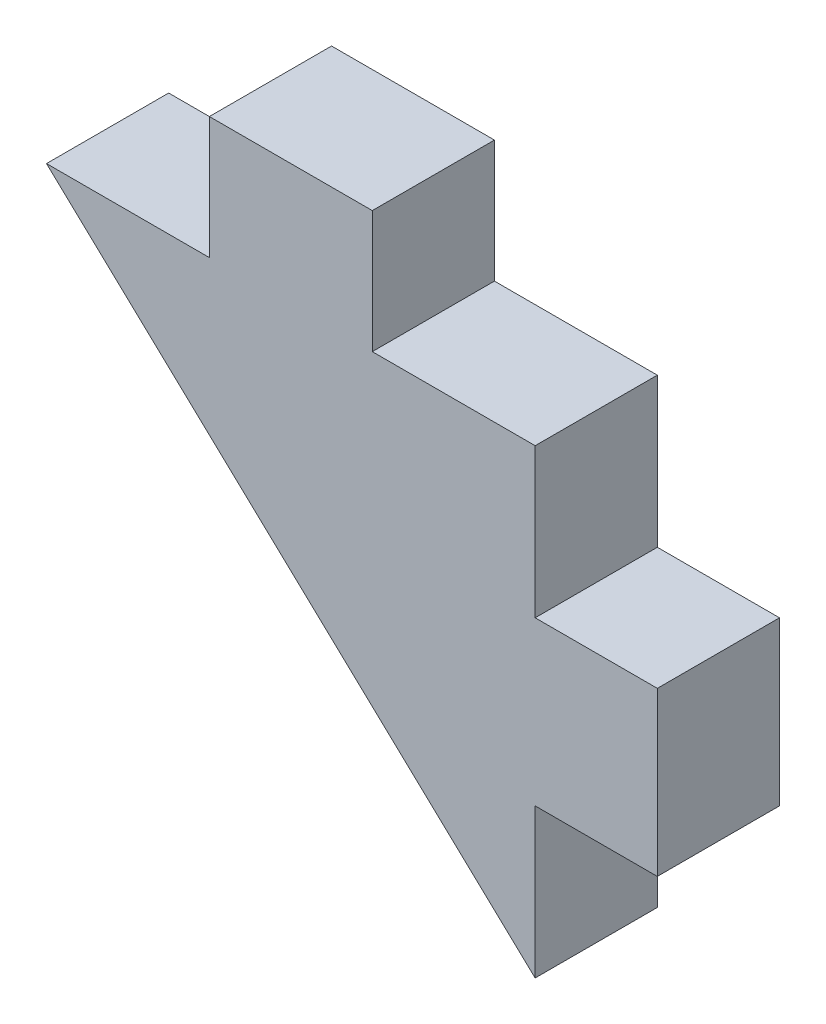
ISO-10303-21;
HEADER;
FILE_DESCRIPTION(('STEP AP214'),'2;1');
FILE_NAME('part.step','',(''),(''),'','','');
FILE_SCHEMA(('AUTOMOTIVE_DESIGN { 1 0 10303 214 1 1 1 1 }'));
ENDSEC;
DATA;
#1=APPLICATION_CONTEXT('core data for automotive mechanical design processes');
#2=APPLICATION_PROTOCOL_DEFINITION('international standard','automotive_design',2000,#1);
#3=PRODUCT_CONTEXT('',#1,'mechanical');
#4=PRODUCT('Part','Part','',(#3));
#5=PRODUCT_RELATED_PRODUCT_CATEGORY('part','',(#4));
#6=PRODUCT_DEFINITION_FORMATION('','',#4);
#7=PRODUCT_DEFINITION_CONTEXT('part definition',#1,'design');
#8=PRODUCT_DEFINITION('design','',#6,#7);
#9=PRODUCT_DEFINITION_SHAPE('','',#8);
#10=(LENGTH_UNIT() NAMED_UNIT(*) SI_UNIT(.MILLI.,.METRE.));
#11=(NAMED_UNIT(*) PLANE_ANGLE_UNIT() SI_UNIT($,.RADIAN.));
#12=(NAMED_UNIT(*) SI_UNIT($,.STERADIAN.) SOLID_ANGLE_UNIT());
#13=UNCERTAINTY_MEASURE_WITH_UNIT(LENGTH_MEASURE(1.E-05),#10,'distance_accuracy_value','');
#14=(GEOMETRIC_REPRESENTATION_CONTEXT(3) GLOBAL_UNCERTAINTY_ASSIGNED_CONTEXT((#13)) GLOBAL_UNIT_ASSIGNED_CONTEXT((#10,
#11,#12)) REPRESENTATION_CONTEXT('',''));
#15=CARTESIAN_POINT('',(0.,0.,0.));
#16=DIRECTION('',(0.,0.,1.));
#17=DIRECTION('',(1.,0.,0.));
#18=AXIS2_PLACEMENT_3D('',#15,#16,#17);
#19=CARTESIAN_POINT('',(10.,3.33333333333333,5.));
#20=DIRECTION('',(-1.,0.,0.));
#21=DIRECTION('',(0.,-1.,0.));
#22=AXIS2_PLACEMENT_3D('',#19,#20,#21);
#23=PLANE('',#22);
#24=DIRECTION('',(0.,1.,0.));
#25=VECTOR('',#24,1.);
#26=CARTESIAN_POINT('',(10.,3.33333333333333,0.));
#27=LINE('',#26,#25);
#28=CARTESIAN_POINT('',(10.,3.33333333333333,0.));
#29=VERTEX_POINT('',#28);
#30=CARTESIAN_POINT('',(10.,9.43396226415095,0.));
#31=VERTEX_POINT('',#30);
#32=EDGE_CURVE('E144',#29,#31,#27,.T.);
#33=ORIENTED_EDGE('',*,*,#32,.T.);
#34=DIRECTION('',(0.,0.,-1.));
#35=VECTOR('',#34,1.);
#36=CARTESIAN_POINT('',(10.,9.43396226415095,5.));
#37=LINE('',#36,#35);
#38=CARTESIAN_POINT('',(10.,9.43396226415095,5.));
#39=VERTEX_POINT('',#38);
#40=EDGE_CURVE('E11',#39,#31,#37,.T.);
#41=ORIENTED_EDGE('',*,*,#40,.F.);
#42=DIRECTION('',(0.,1.,0.));
#43=VECTOR('',#42,1.);
#44=CARTESIAN_POINT('',(10.,3.33333333333333,5.));
#45=LINE('',#44,#43);
#46=CARTESIAN_POINT('',(10.,3.33333333333333,5.));
#47=VERTEX_POINT('',#46);
#48=EDGE_CURVE('E164',#47,#39,#45,.T.);
#49=ORIENTED_EDGE('',*,*,#48,.F.);
#50=DIRECTION('',(0.,0.,-1.));
#51=VECTOR('',#50,1.);
#52=CARTESIAN_POINT('',(10.,3.33333333333333,5.));
#53=LINE('',#52,#51);
#54=EDGE_CURVE('E140',#47,#29,#53,.T.);
#55=ORIENTED_EDGE('',*,*,#54,.T.);
#56=EDGE_LOOP('',(#33,#41,#49,#55));
#57=FACE_BOUND('',#56,.T.);
#58=ADVANCED_FACE('F30',(#57),#23,.F.);
#59=CARTESIAN_POINT('',(3.33333333333333,9.43396226415095,5.));
#60=DIRECTION('',(0.,-1.,0.));
#61=DIRECTION('',(1.,0.,0.));
#62=AXIS2_PLACEMENT_3D('',#59,#60,#61);
#63=PLANE('',#62);
#64=DIRECTION('',(-1.,0.,0.));
#65=VECTOR('',#64,1.);
#66=CARTESIAN_POINT('',(3.33333333333333,9.43396226415095,0.));
#67=LINE('',#66,#65);
#68=CARTESIAN_POINT('',(3.33333333333333,9.43396226415095,0.));
#69=VERTEX_POINT('',#68);
#70=EDGE_CURVE('E147',#31,#69,#67,.T.);
#71=ORIENTED_EDGE('',*,*,#70,.T.);
#72=DIRECTION('',(0.,0.,-1.));
#73=VECTOR('',#72,1.);
#74=CARTESIAN_POINT('',(3.33333333333333,9.43396226415095,5.));
#75=LINE('',#74,#73);
#76=CARTESIAN_POINT('',(3.33333333333333,9.43396226415095,5.));
#77=VERTEX_POINT('',#76);
#78=EDGE_CURVE('E38',#77,#69,#75,.T.);
#79=ORIENTED_EDGE('',*,*,#78,.F.);
#80=DIRECTION('',(-1.,0.,0.));
#81=VECTOR('',#80,1.);
#82=CARTESIAN_POINT('',(3.33333333333333,9.43396226415095,5.));
#83=LINE('',#82,#81);
#84=EDGE_CURVE('E98',#39,#77,#83,.T.);
#85=ORIENTED_EDGE('',*,*,#84,.F.);
#86=ORIENTED_EDGE('',*,*,#40,.T.);
#87=EDGE_LOOP('',(#71,#79,#85,#86));
#88=FACE_BOUND('',#87,.T.);
#89=ADVANCED_FACE('F236',(#88),#63,.F.);
#90=CARTESIAN_POINT('',(3.33333333333333,9.43396226415095,5.));
#91=DIRECTION('',(-1.,0.,0.));
#92=DIRECTION('',(0.,-1.,0.));
#93=AXIS2_PLACEMENT_3D('',#90,#91,#92);
#94=PLANE('',#93);
#95=DIRECTION('',(0.,1.,0.));
#96=VECTOR('',#95,1.);
#97=CARTESIAN_POINT('',(3.33333333333333,9.43396226415095,0.));
#98=LINE('',#97,#96);
#99=CARTESIAN_POINT('',(3.33333333333333,14.4339622641509,0.));
#100=VERTEX_POINT('',#99);
#101=EDGE_CURVE('E149',#69,#100,#98,.T.);
#102=ORIENTED_EDGE('',*,*,#101,.T.);
#103=DIRECTION('',(0.,0.,-1.));
#104=VECTOR('',#103,1.);
#105=CARTESIAN_POINT('',(3.33333333333333,14.4339622641509,5.));
#106=LINE('',#105,#104);
#107=CARTESIAN_POINT('',(3.33333333333333,14.4339622641509,5.));
#108=VERTEX_POINT('',#107);
#109=EDGE_CURVE('E180',#108,#100,#106,.T.);
#110=ORIENTED_EDGE('',*,*,#109,.F.);
#111=DIRECTION('',(0.,1.,0.));
#112=VECTOR('',#111,1.);
#113=CARTESIAN_POINT('',(3.33333333333333,9.43396226415095,5.));
#114=LINE('',#113,#112);
#115=EDGE_CURVE('E188',#77,#108,#114,.T.);
#116=ORIENTED_EDGE('',*,*,#115,.F.);
#117=ORIENTED_EDGE('',*,*,#78,.T.);
#118=EDGE_LOOP('',(#102,#110,#116,#117));
#119=FACE_BOUND('',#118,.T.);
#120=ADVANCED_FACE('F186',(#119),#94,.F.);
#121=CARTESIAN_POINT('',(-3.33333333333333,14.4339622641509,5.));
#122=DIRECTION('',(0.,-1.,0.));
#123=DIRECTION('',(0.,0.,-1.));
#124=AXIS2_PLACEMENT_3D('',#121,#122,#123);
#125=PLANE('',#124);
#126=DIRECTION('',(-1.,0.,0.));
#127=VECTOR('',#126,1.);
#128=CARTESIAN_POINT('',(-3.33333333333333,14.4339622641509,0.));
#129=LINE('',#128,#127);
#130=CARTESIAN_POINT('',(-3.33333333333333,14.4339622641509,0.));
#131=VERTEX_POINT('',#130);
#132=EDGE_CURVE('E151',#100,#131,#129,.T.);
#133=ORIENTED_EDGE('',*,*,#132,.T.);
#134=DIRECTION('',(0.,0.,-1.));
#135=VECTOR('',#134,1.);
#136=CARTESIAN_POINT('',(-3.33333333333333,14.4339622641509,5.));
#137=LINE('',#136,#135);
#138=CARTESIAN_POINT('',(-3.33333333333333,14.4339622641509,5.));
#139=VERTEX_POINT('',#138);
#140=EDGE_CURVE('E177',#139,#131,#137,.T.);
#141=ORIENTED_EDGE('',*,*,#140,.F.);
#142=DIRECTION('',(-1.,0.,0.));
#143=VECTOR('',#142,1.);
#144=CARTESIAN_POINT('',(-3.33333333333333,14.4339622641509,5.));
#145=LINE('',#144,#143);
#146=EDGE_CURVE('E206',#108,#139,#145,.T.);
#147=ORIENTED_EDGE('',*,*,#146,.F.);
#148=ORIENTED_EDGE('',*,*,#109,.T.);
#149=EDGE_LOOP('',(#133,#141,#147,#148));
#150=FACE_BOUND('',#149,.T.);
#151=ADVANCED_FACE('F197',(#150),#125,.F.);
#152=CARTESIAN_POINT('',(-3.33333333333333,9.43396226415095,5.));
#153=DIRECTION('',(1.,0.,0.));
#154=DIRECTION('',(0.,1.,0.));
#155=AXIS2_PLACEMENT_3D('',#152,#153,#154);
#156=PLANE('',#155);
#157=DIRECTION('',(0.,-1.,0.));
#158=VECTOR('',#157,1.);
#159=CARTESIAN_POINT('',(-3.33333333333333,9.43396226415095,0.));
#160=LINE('',#159,#158);
#161=CARTESIAN_POINT('',(-3.33333333333333,9.43396226415095,0.));
#162=VERTEX_POINT('',#161);
#163=EDGE_CURVE('E153',#131,#162,#160,.T.);
#164=ORIENTED_EDGE('',*,*,#163,.T.);
#165=DIRECTION('',(0.,0.,-1.));
#166=VECTOR('',#165,1.);
#167=CARTESIAN_POINT('',(-3.33333333333333,9.43396226415095,5.));
#168=LINE('',#167,#166);
#169=CARTESIAN_POINT('',(-3.33333333333333,9.43396226415095,5.));
#170=VERTEX_POINT('',#169);
#171=EDGE_CURVE('E174',#170,#162,#168,.T.);
#172=ORIENTED_EDGE('',*,*,#171,.F.);
#173=DIRECTION('',(0.,-1.,0.));
#174=VECTOR('',#173,1.);
#175=CARTESIAN_POINT('',(-3.33333333333333,9.43396226415095,5.));
#176=LINE('',#175,#174);
#177=EDGE_CURVE('E203',#139,#170,#176,.T.);
#178=ORIENTED_EDGE('',*,*,#177,.F.);
#179=ORIENTED_EDGE('',*,*,#140,.T.);
#180=EDGE_LOOP('',(#164,#172,#178,#179));
#181=FACE_BOUND('',#180,.T.);
#182=ADVANCED_FACE('F201',(#181),#156,.F.);
#183=CARTESIAN_POINT('',(-10.,9.43396226415095,5.));
#184=DIRECTION('',(0.,-1.,0.));
#185=DIRECTION('',(1.,0.,0.));
#186=AXIS2_PLACEMENT_3D('',#183,#184,#185);
#187=PLANE('',#186);
#188=DIRECTION('',(-1.,0.,0.));
#189=VECTOR('',#188,1.);
#190=CARTESIAN_POINT('',(-10.,9.43396226415095,0.));
#191=LINE('',#190,#189);
#192=CARTESIAN_POINT('',(-10.,9.43396226415095,0.));
#193=VERTEX_POINT('',#192);
#194=EDGE_CURVE('E155',#162,#193,#191,.T.);
#195=ORIENTED_EDGE('',*,*,#194,.T.);
#196=DIRECTION('',(0.,0.,-1.));
#197=VECTOR('',#196,1.);
#198=CARTESIAN_POINT('',(-10.,9.43396226415095,5.));
#199=LINE('',#198,#197);
#200=CARTESIAN_POINT('',(-10.,9.43396226415095,5.));
#201=VERTEX_POINT('',#200);
#202=EDGE_CURVE('E171',#201,#193,#199,.T.);
#203=ORIENTED_EDGE('',*,*,#202,.F.);
#204=DIRECTION('',(-1.,0.,0.));
#205=VECTOR('',#204,1.);
#206=CARTESIAN_POINT('',(-10.,9.43396226415095,5.));
#207=LINE('',#206,#205);
#208=EDGE_CURVE('E205',#170,#201,#207,.T.);
#209=ORIENTED_EDGE('',*,*,#208,.F.);
#210=ORIENTED_EDGE('',*,*,#171,.T.);
#211=EDGE_LOOP('',(#195,#203,#209,#210));
#212=FACE_BOUND('',#211,.T.);
#213=ADVANCED_FACE('F249',(#212),#187,.F.);
#214=CARTESIAN_POINT('',(-10.,9.43396226415095,5.));
#215=DIRECTION('',(0.686220426895719,0.727393652509463,0.));
#216=DIRECTION('',(-0.727393652509463,0.686220426895719,0.));
#217=AXIS2_PLACEMENT_3D('',#214,#215,#216);
#218=PLANE('',#217);
#219=DIRECTION('',(0.727393652509463,-0.686220426895719,0.));
#220=VECTOR('',#219,1.);
#221=CARTESIAN_POINT('',(-10.,9.43396226415095,0.));
#222=LINE('',#221,#220);
#223=CARTESIAN_POINT('',(10.,-9.43396226415094,0.));
#224=VERTEX_POINT('',#223);
#225=EDGE_CURVE('E157',#193,#224,#222,.T.);
#226=ORIENTED_EDGE('',*,*,#225,.T.);
#227=DIRECTION('',(0.,0.,-1.));
#228=VECTOR('',#227,1.);
#229=CARTESIAN_POINT('',(10.,-9.43396226415094,5.));
#230=LINE('',#229,#228);
#231=CARTESIAN_POINT('',(10.,-9.43396226415094,5.));
#232=VERTEX_POINT('',#231);
#233=EDGE_CURVE('E168',#232,#224,#230,.T.);
#234=ORIENTED_EDGE('',*,*,#233,.F.);
#235=DIRECTION('',(0.727393652509463,-0.686220426895719,0.));
#236=VECTOR('',#235,1.);
#237=CARTESIAN_POINT('',(-10.,9.43396226415095,5.));
#238=LINE('',#237,#236);
#239=EDGE_CURVE('E208',#201,#232,#238,.T.);
#240=ORIENTED_EDGE('',*,*,#239,.F.);
#241=ORIENTED_EDGE('',*,*,#202,.T.);
#242=EDGE_LOOP('',(#226,#234,#240,#241));
#243=FACE_BOUND('',#242,.T.);
#244=ADVANCED_FACE('F217',(#243),#218,.F.);
#245=CARTESIAN_POINT('',(10.,-9.43396226415094,5.));
#246=DIRECTION('',(-1.,0.,0.));
#247=DIRECTION('',(0.,-1.,0.));
#248=AXIS2_PLACEMENT_3D('',#245,#246,#247);
#249=PLANE('',#248);
#250=DIRECTION('',(0.,1.,0.));
#251=VECTOR('',#250,1.);
#252=CARTESIAN_POINT('',(10.,-9.43396226415094,0.));
#253=LINE('',#252,#251);
#254=CARTESIAN_POINT('',(10.,-3.33333333333333,0.));
#255=VERTEX_POINT('',#254);
#256=EDGE_CURVE('E159',#224,#255,#253,.T.);
#257=ORIENTED_EDGE('',*,*,#256,.T.);
#258=DIRECTION('',(0.,0.,-1.));
#259=VECTOR('',#258,1.);
#260=CARTESIAN_POINT('',(10.,-3.33333333333333,5.));
#261=LINE('',#260,#259);
#262=CARTESIAN_POINT('',(10.,-3.33333333333333,5.));
#263=VERTEX_POINT('',#262);
#264=EDGE_CURVE('E135',#263,#255,#261,.T.);
#265=ORIENTED_EDGE('',*,*,#264,.F.);
#266=DIRECTION('',(0.,1.,0.));
#267=VECTOR('',#266,1.);
#268=CARTESIAN_POINT('',(10.,-9.43396226415094,5.));
#269=LINE('',#268,#267);
#270=EDGE_CURVE('E126',#232,#263,#269,.T.);
#271=ORIENTED_EDGE('',*,*,#270,.F.);
#272=ORIENTED_EDGE('',*,*,#233,.T.);
#273=EDGE_LOOP('',(#257,#265,#271,#272));
#274=FACE_BOUND('',#273,.T.);
#275=ADVANCED_FACE('F221',(#274),#249,.F.);
#276=CARTESIAN_POINT('',(10.,-3.33333333333333,5.));
#277=DIRECTION('',(0.,1.,0.));
#278=DIRECTION('',(0.,0.,1.));
#279=AXIS2_PLACEMENT_3D('',#276,#277,#278);
#280=PLANE('',#279);
#281=DIRECTION('',(1.,0.,0.));
#282=VECTOR('',#281,1.);
#283=CARTESIAN_POINT('',(10.,-3.33333333333333,0.));
#284=LINE('',#283,#282);
#285=CARTESIAN_POINT('',(15.,-3.33333333333333,0.));
#286=VERTEX_POINT('',#285);
#287=EDGE_CURVE('E134',#255,#286,#284,.T.);
#288=ORIENTED_EDGE('',*,*,#287,.T.);
#289=DIRECTION('',(0.,0.,-1.));
#290=VECTOR('',#289,1.);
#291=CARTESIAN_POINT('',(15.,-3.33333333333333,5.));
#292=LINE('',#291,#290);
#293=CARTESIAN_POINT('',(15.,-3.33333333333333,5.));
#294=VERTEX_POINT('',#293);
#295=EDGE_CURVE('E131',#294,#286,#292,.T.);
#296=ORIENTED_EDGE('',*,*,#295,.F.);
#297=DIRECTION('',(1.,0.,0.));
#298=VECTOR('',#297,1.);
#299=CARTESIAN_POINT('',(10.,-3.33333333333333,5.));
#300=LINE('',#299,#298);
#301=EDGE_CURVE('E120',#263,#294,#300,.T.);
#302=ORIENTED_EDGE('',*,*,#301,.F.);
#303=ORIENTED_EDGE('',*,*,#264,.T.);
#304=EDGE_LOOP('',(#288,#296,#302,#303));
#305=FACE_BOUND('',#304,.T.);
#306=ADVANCED_FACE('F132',(#305),#280,.F.);
#307=CARTESIAN_POINT('',(15.,-3.33333333333333,5.));
#308=DIRECTION('',(-1.,0.,0.));
#309=DIRECTION('',(0.,-1.,0.));
#310=AXIS2_PLACEMENT_3D('',#307,#308,#309);
#311=PLANE('',#310);
#312=DIRECTION('',(0.,1.,0.));
#313=VECTOR('',#312,1.);
#314=CARTESIAN_POINT('',(15.,-3.33333333333333,0.));
#315=LINE('',#314,#313);
#316=CARTESIAN_POINT('',(15.,3.33333333333333,0.));
#317=VERTEX_POINT('',#316);
#318=EDGE_CURVE('E84',#286,#317,#315,.T.);
#319=ORIENTED_EDGE('',*,*,#318,.T.);
#320=DIRECTION('',(0.,0.,-1.));
#321=VECTOR('',#320,1.);
#322=CARTESIAN_POINT('',(15.,3.33333333333333,5.));
#323=LINE('',#322,#321);
#324=CARTESIAN_POINT('',(15.,3.33333333333333,5.));
#325=VERTEX_POINT('',#324);
#326=EDGE_CURVE('E136',#325,#317,#323,.T.);
#327=ORIENTED_EDGE('',*,*,#326,.F.);
#328=DIRECTION('',(0.,1.,0.));
#329=VECTOR('',#328,1.);
#330=CARTESIAN_POINT('',(15.,-3.33333333333333,5.));
#331=LINE('',#330,#329);
#332=EDGE_CURVE('E124',#294,#325,#331,.T.);
#333=ORIENTED_EDGE('',*,*,#332,.F.);
#334=ORIENTED_EDGE('',*,*,#295,.T.);
#335=EDGE_LOOP('',(#319,#327,#333,#334));
#336=FACE_BOUND('',#335,.T.);
#337=ADVANCED_FACE('F138',(#336),#311,.F.);
#338=CARTESIAN_POINT('',(10.,3.33333333333333,5.));
#339=DIRECTION('',(0.,-1.,0.));
#340=DIRECTION('',(1.,0.,0.));
#341=AXIS2_PLACEMENT_3D('',#338,#339,#340);
#342=PLANE('',#341);
#343=DIRECTION('',(-1.,0.,0.));
#344=VECTOR('',#343,1.);
#345=CARTESIAN_POINT('',(10.,3.33333333333333,0.));
#346=LINE('',#345,#344);
#347=EDGE_CURVE('E90',#317,#29,#346,.T.);
#348=ORIENTED_EDGE('',*,*,#347,.T.);
#349=ORIENTED_EDGE('',*,*,#54,.F.);
#350=DIRECTION('',(-1.,0.,0.));
#351=VECTOR('',#350,1.);
#352=CARTESIAN_POINT('',(10.,3.33333333333333,5.));
#353=LINE('',#352,#351);
#354=EDGE_CURVE('E46',#325,#47,#353,.T.);
#355=ORIENTED_EDGE('',*,*,#354,.F.);
#356=ORIENTED_EDGE('',*,*,#326,.T.);
#357=EDGE_LOOP('',(#348,#349,#355,#356));
#358=FACE_BOUND('',#357,.T.);
#359=ADVANCED_FACE('F225',(#358),#342,.F.);
#360=CARTESIAN_POINT('',(10.,9.43396226415095,5.));
#361=DIRECTION('',(0.,0.,-1.));
#362=DIRECTION('',(-1.,0.,0.));
#363=AXIS2_PLACEMENT_3D('',#360,#361,#362);
#364=PLANE('',#363);
#365=ORIENTED_EDGE('',*,*,#48,.T.);
#366=ORIENTED_EDGE('',*,*,#84,.T.);
#367=ORIENTED_EDGE('',*,*,#115,.T.);
#368=ORIENTED_EDGE('',*,*,#146,.T.);
#369=ORIENTED_EDGE('',*,*,#177,.T.);
#370=ORIENTED_EDGE('',*,*,#208,.T.);
#371=ORIENTED_EDGE('',*,*,#239,.T.);
#372=ORIENTED_EDGE('',*,*,#270,.T.);
#373=ORIENTED_EDGE('',*,*,#301,.T.);
#374=ORIENTED_EDGE('',*,*,#332,.T.);
#375=ORIENTED_EDGE('',*,*,#354,.T.);
#376=EDGE_LOOP('',(#365,#366,#367,#368,#369,#370,#371,#372,#373,#374,#375));
#377=FACE_BOUND('',#376,.T.);
#378=ADVANCED_FACE('F122',(#377),#364,.F.);
#379=CARTESIAN_POINT('',(10.,9.43396226415095,0.));
#380=DIRECTION('',(0.,0.,-1.));
#381=DIRECTION('',(-1.,0.,0.));
#382=AXIS2_PLACEMENT_3D('',#379,#380,#381);
#383=PLANE('',#382);
#384=ORIENTED_EDGE('',*,*,#32,.F.);
#385=ORIENTED_EDGE('',*,*,#347,.F.);
#386=ORIENTED_EDGE('',*,*,#318,.F.);
#387=ORIENTED_EDGE('',*,*,#287,.F.);
#388=ORIENTED_EDGE('',*,*,#256,.F.);
#389=ORIENTED_EDGE('',*,*,#225,.F.);
#390=ORIENTED_EDGE('',*,*,#194,.F.);
#391=ORIENTED_EDGE('',*,*,#163,.F.);
#392=ORIENTED_EDGE('',*,*,#132,.F.);
#393=ORIENTED_EDGE('',*,*,#101,.F.);
#394=ORIENTED_EDGE('',*,*,#70,.F.);
#395=EDGE_LOOP('',(#384,#385,#386,#387,#388,#389,#390,#391,#392,#393,#394));
#396=FACE_BOUND('',#395,.T.);
#397=ADVANCED_FACE('F192',(#396),#383,.T.);
#398=CLOSED_SHELL('',(#58,#89,#120,#151,#182,#213,#244,#275,#306,#337,#359,#378,#397));
#399=MANIFOLD_SOLID_BREP('B2',#398);
#400=ADVANCED_BREP_SHAPE_REPRESENTATION('',(#18,#399),#14);
#401=SHAPE_DEFINITION_REPRESENTATION(#9,#400);
ENDSEC;
END-ISO-10303-21;
